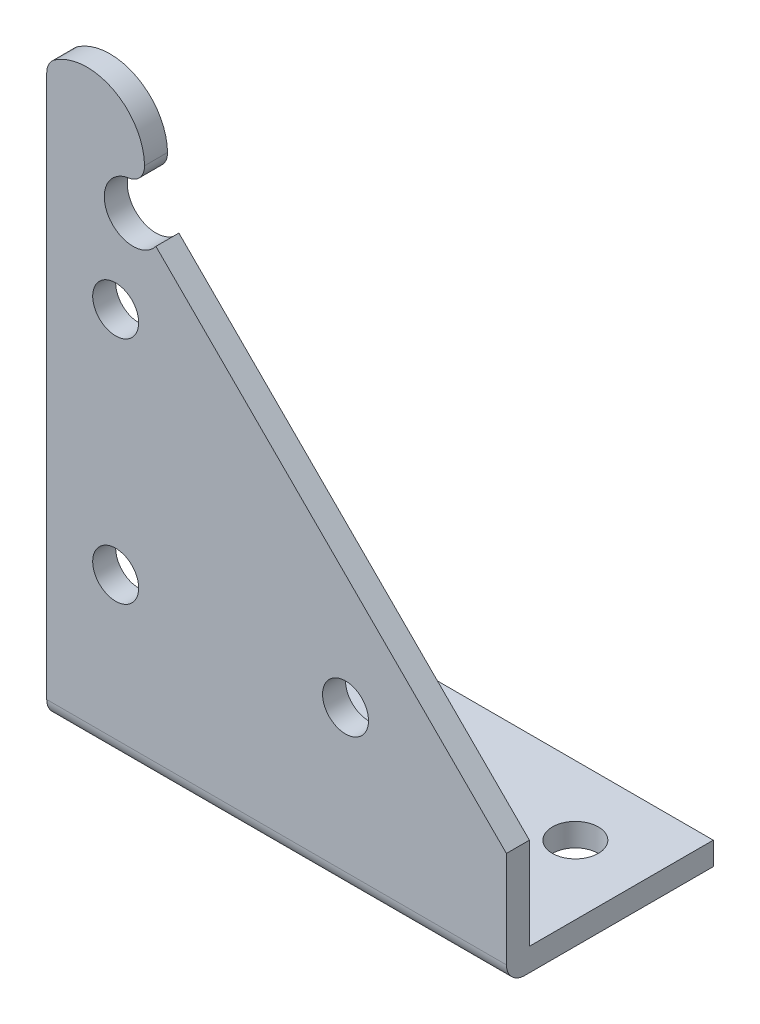
ISO-10303-21;
HEADER;
FILE_DESCRIPTION(('STEP AP214'),'2;1');
FILE_NAME('part.step','',(''),(''),'','','');
FILE_SCHEMA(('AUTOMOTIVE_DESIGN { 1 0 10303 214 1 1 1 1 }'));
ENDSEC;
DATA;
#1=APPLICATION_CONTEXT('core data for automotive mechanical design processes');
#2=APPLICATION_PROTOCOL_DEFINITION('international standard','automotive_design',2000,#1);
#3=PRODUCT_CONTEXT('',#1,'mechanical');
#4=PRODUCT('Part','Part','',(#3));
#5=PRODUCT_RELATED_PRODUCT_CATEGORY('part','',(#4));
#6=PRODUCT_DEFINITION_FORMATION('','',#4);
#7=PRODUCT_DEFINITION_CONTEXT('part definition',#1,'design');
#8=PRODUCT_DEFINITION('design','',#6,#7);
#9=PRODUCT_DEFINITION_SHAPE('','',#8);
#10=(LENGTH_UNIT() NAMED_UNIT(*) SI_UNIT(.MILLI.,.METRE.));
#11=(NAMED_UNIT(*) PLANE_ANGLE_UNIT() SI_UNIT($,.RADIAN.));
#12=(NAMED_UNIT(*) SI_UNIT($,.STERADIAN.) SOLID_ANGLE_UNIT());
#13=UNCERTAINTY_MEASURE_WITH_UNIT(LENGTH_MEASURE(1.E-05),#10,'distance_accuracy_value','');
#14=(GEOMETRIC_REPRESENTATION_CONTEXT(3) GLOBAL_UNCERTAINTY_ASSIGNED_CONTEXT((#13)) GLOBAL_UNIT_ASSIGNED_CONTEXT((#10,
#11,#12)) REPRESENTATION_CONTEXT('',''));
#15=CARTESIAN_POINT('',(0.,0.,0.));
#16=DIRECTION('',(0.,0.,1.));
#17=DIRECTION('',(1.,0.,0.));
#18=AXIS2_PLACEMENT_3D('',#15,#16,#17);
#19=CARTESIAN_POINT('',(-29.3624,44.45,-3.175));
#20=DIRECTION('',(0.,0.,-1.));
#21=DIRECTION('',(1.,0.,0.));
#22=AXIS2_PLACEMENT_3D('',#19,#20,#21);
#23=PLANE('',#22);
#24=DIRECTION('',(-1.,0.,0.));
#25=VECTOR('',#24,1.);
#26=CARTESIAN_POINT('',(-41.275,-19.05,-3.175));
#27=LINE('',#26,#25);
#28=CARTESIAN_POINT('',(22.225,-19.05,-3.175));
#29=VERTEX_POINT('',#28);
#30=CARTESIAN_POINT('',(-41.275,-19.05,-3.175));
#31=VERTEX_POINT('',#30);
#32=EDGE_CURVE('E152',#29,#31,#27,.T.);
#33=ORIENTED_EDGE('',*,*,#32,.T.);
#34=DIRECTION('',(0.,-1.,0.));
#35=VECTOR('',#34,1.);
#36=CARTESIAN_POINT('',(-41.275,55.287109679961,-3.175));
#37=LINE('',#36,#35);
#38=CARTESIAN_POINT('',(-41.275,55.287109679961,-3.175));
#39=VERTEX_POINT('',#38);
#40=EDGE_CURVE('E142',#39,#31,#37,.T.);
#41=ORIENTED_EDGE('',*,*,#40,.F.);
#42=CARTESIAN_POINT('',(-38.735,55.287109679961,-3.175));
#43=DIRECTION('',(0.,0.,1.));
#44=DIRECTION('',(-1.,0.,0.));
#45=AXIS2_PLACEMENT_3D('',#42,#43,#44);
#46=CIRCLE('',#45,2.54);
#47=CARTESIAN_POINT('',(-40.1540610328639,57.3937339428535,-3.175));
#48=VERTEX_POINT('',#47);
#49=EDGE_CURVE('E189',#48,#39,#46,.T.);
#50=ORIENTED_EDGE('',*,*,#49,.F.);
#51=CARTESIAN_POINT('',(-35.7124,50.8,-3.175));
#52=DIRECTION('',(0.,0.,1.));
#53=DIRECTION('',(1.,0.,0.));
#54=AXIS2_PLACEMENT_3D('',#51,#52,#53);
#55=CIRCLE('',#54,7.95019999999999);
#56=CARTESIAN_POINT('',(-27.7631590173173,50.9234821413682,-3.175));
#57=VERTEX_POINT('',#56);
#58=EDGE_CURVE('E186',#57,#48,#55,.T.);
#59=ORIENTED_EDGE('',*,*,#58,.F.);
#60=CARTESIAN_POINT('',(-30.3028526220082,50.8840309779918,-3.175));
#61=DIRECTION('',(0.,0.,1.));
#62=DIRECTION('',(1.,0.,0.));
#63=AXIS2_PLACEMENT_3D('',#60,#61,#62);
#64=CIRCLE('',#63,2.54);
#65=CARTESIAN_POINT('',(-29.9354883165363,48.3707376272137,-3.175));
#66=VERTEX_POINT('',#65);
#67=EDGE_CURVE('E183',#66,#57,#64,.T.);
#68=ORIENTED_EDGE('',*,*,#67,.F.);
#69=CARTESIAN_POINT('',(-29.3624,44.45,-3.175));
#70=DIRECTION('',(0.,0.,-1.));
#71=DIRECTION('',(1.,0.,0.));
#72=AXIS2_PLACEMENT_3D('',#69,#70,#71);
#73=CIRCLE('',#72,3.9624);
#74=CARTESIAN_POINT('',(-26.1946583294408,42.0696583294403,-3.175));
#75=VERTEX_POINT('',#74);
#76=EDGE_CURVE('E180',#75,#66,#73,.T.);
#77=ORIENTED_EDGE('',*,*,#76,.F.);
#78=DIRECTION('',(-0.707106781186551,0.707106781186544,0.));
#79=VECTOR('',#78,1.);
#80=CARTESIAN_POINT('',(22.225,-6.34999999999999,-3.175));
#81=LINE('',#80,#79);
#82=CARTESIAN_POINT('',(22.225,-6.34999999999999,-3.175));
#83=VERTEX_POINT('',#82);
#84=EDGE_CURVE('E176',#83,#75,#81,.T.);
#85=ORIENTED_EDGE('',*,*,#84,.F.);
#86=DIRECTION('',(0.,1.,0.));
#87=VECTOR('',#86,1.);
#88=CARTESIAN_POINT('',(22.225,-22.225,-3.175));
#89=LINE('',#88,#87);
#90=EDGE_CURVE('E173',#29,#83,#89,.T.);
#91=ORIENTED_EDGE('',*,*,#90,.F.);
#92=EDGE_LOOP('',(#33,#41,#50,#59,#68,#77,#85,#91));
#93=FACE_BOUND('',#92,.T.);
#94=CARTESIAN_POINT('',(-31.75,0.,-3.175));
#95=DIRECTION('',(0.,0.,1.));
#96=DIRECTION('',(1.,0.,0.));
#97=AXIS2_PLACEMENT_3D('',#94,#95,#96);
#98=CIRCLE('',#97,3.175);
#99=CARTESIAN_POINT('',(-28.575,0.,-3.175));
#100=VERTEX_POINT('',#99);
#101=EDGE_CURVE('E161',#100,#100,#98,.T.);
#102=ORIENTED_EDGE('',*,*,#101,.T.);
#103=EDGE_LOOP('',(#102));
#104=FACE_BOUND('',#103,.T.);
#105=CARTESIAN_POINT('',(0.,0.,-3.175));
#106=DIRECTION('',(0.,0.,1.));
#107=DIRECTION('',(1.,0.,0.));
#108=AXIS2_PLACEMENT_3D('',#105,#106,#107);
#109=CIRCLE('',#108,3.175);
#110=CARTESIAN_POINT('',(3.175,0.,-3.175));
#111=VERTEX_POINT('',#110);
#112=EDGE_CURVE('E167',#111,#111,#109,.T.);
#113=ORIENTED_EDGE('',*,*,#112,.T.);
#114=EDGE_LOOP('',(#113));
#115=FACE_BOUND('',#114,.T.);
#116=CARTESIAN_POINT('',(-31.75,31.75,-3.175));
#117=DIRECTION('',(0.,0.,1.));
#118=DIRECTION('',(1.,0.,0.));
#119=AXIS2_PLACEMENT_3D('',#116,#117,#118);
#120=CIRCLE('',#119,3.175);
#121=CARTESIAN_POINT('',(-28.575,31.75,-3.175));
#122=VERTEX_POINT('',#121);
#123=EDGE_CURVE('E155',#122,#122,#120,.T.);
#124=ORIENTED_EDGE('',*,*,#123,.T.);
#125=EDGE_LOOP('',(#124));
#126=FACE_BOUND('',#125,.T.);
#127=ADVANCED_FACE('F37',(#93,#104,#115,#126),#23,.T.);
#128=CARTESIAN_POINT('',(-29.3624,44.45,0.));
#129=DIRECTION('',(0.,0.,-1.));
#130=DIRECTION('',(1.,0.,0.));
#131=AXIS2_PLACEMENT_3D('',#128,#129,#130);
#132=PLANE('',#131);
#133=DIRECTION('',(0.,1.,0.));
#134=VECTOR('',#133,1.);
#135=CARTESIAN_POINT('',(22.225,-22.225,0.));
#136=LINE('',#135,#134);
#137=CARTESIAN_POINT('',(22.225,-19.685,0.));
#138=VERTEX_POINT('',#137);
#139=CARTESIAN_POINT('',(22.225,-6.34999999999999,0.));
#140=VERTEX_POINT('',#139);
#141=EDGE_CURVE('E170',#138,#140,#136,.T.);
#142=ORIENTED_EDGE('',*,*,#141,.T.);
#143=DIRECTION('',(-0.707106781186551,0.707106781186544,0.));
#144=VECTOR('',#143,1.);
#145=CARTESIAN_POINT('',(22.225,-6.34999999999999,0.));
#146=LINE('',#145,#144);
#147=CARTESIAN_POINT('',(-26.1946583294408,42.0696583294403,0.));
#148=VERTEX_POINT('',#147);
#149=EDGE_CURVE('E196',#140,#148,#146,.T.);
#150=ORIENTED_EDGE('',*,*,#149,.T.);
#151=CARTESIAN_POINT('',(-29.3624,44.45,0.));
#152=DIRECTION('',(0.,0.,-1.));
#153=DIRECTION('',(1.,0.,0.));
#154=AXIS2_PLACEMENT_3D('',#151,#152,#153);
#155=CIRCLE('',#154,3.9624);
#156=CARTESIAN_POINT('',(-29.9354883165363,48.3707376272137,0.));
#157=VERTEX_POINT('',#156);
#158=EDGE_CURVE('E199',#148,#157,#155,.T.);
#159=ORIENTED_EDGE('',*,*,#158,.T.);
#160=CARTESIAN_POINT('',(-30.3028526220082,50.8840309779918,0.));
#161=DIRECTION('',(0.,0.,1.));
#162=DIRECTION('',(1.,0.,0.));
#163=AXIS2_PLACEMENT_3D('',#160,#161,#162);
#164=CIRCLE('',#163,2.54);
#165=CARTESIAN_POINT('',(-27.7631590173173,50.9234821413682,0.));
#166=VERTEX_POINT('',#165);
#167=EDGE_CURVE('E202',#157,#166,#164,.T.);
#168=ORIENTED_EDGE('',*,*,#167,.T.);
#169=CARTESIAN_POINT('',(-35.7124,50.8,0.));
#170=DIRECTION('',(0.,0.,1.));
#171=DIRECTION('',(1.,0.,0.));
#172=AXIS2_PLACEMENT_3D('',#169,#170,#171);
#173=CIRCLE('',#172,7.95019999999999);
#174=CARTESIAN_POINT('',(-40.1540610328639,57.3937339428535,0.));
#175=VERTEX_POINT('',#174);
#176=EDGE_CURVE('E205',#166,#175,#173,.T.);
#177=ORIENTED_EDGE('',*,*,#176,.T.);
#178=CARTESIAN_POINT('',(-38.735,55.287109679961,0.));
#179=DIRECTION('',(0.,0.,1.));
#180=DIRECTION('',(-1.,0.,0.));
#181=AXIS2_PLACEMENT_3D('',#178,#179,#180);
#182=CIRCLE('',#181,2.54);
#183=CARTESIAN_POINT('',(-41.275,55.287109679961,0.));
#184=VERTEX_POINT('',#183);
#185=EDGE_CURVE('E208',#175,#184,#182,.T.);
#186=ORIENTED_EDGE('',*,*,#185,.T.);
#187=DIRECTION('',(0.,-1.,0.));
#188=VECTOR('',#187,1.);
#189=CARTESIAN_POINT('',(-41.275,55.287109679961,0.));
#190=LINE('',#189,#188);
#191=CARTESIAN_POINT('',(-41.275,-19.685,0.));
#192=VERTEX_POINT('',#191);
#193=EDGE_CURVE('E177',#184,#192,#190,.T.);
#194=ORIENTED_EDGE('',*,*,#193,.T.);
#195=DIRECTION('',(1.,0.,0.));
#196=VECTOR('',#195,1.);
#197=CARTESIAN_POINT('',(-29.3624,-19.685,0.));
#198=LINE('',#197,#196);
#199=EDGE_CURVE('E45',#138,#192,#198,.F.);
#200=ORIENTED_EDGE('',*,*,#199,.F.);
#201=EDGE_LOOP('',(#142,#150,#159,#168,#177,#186,#194,#200));
#202=FACE_BOUND('',#201,.T.);
#203=CARTESIAN_POINT('',(0.,0.,0.));
#204=DIRECTION('',(0.,0.,1.));
#205=DIRECTION('',(1.,0.,0.));
#206=AXIS2_PLACEMENT_3D('',#203,#204,#205);
#207=CIRCLE('',#206,3.175);
#208=CARTESIAN_POINT('',(3.175,0.,0.));
#209=VERTEX_POINT('',#208);
#210=EDGE_CURVE('E164',#209,#209,#207,.T.);
#211=ORIENTED_EDGE('',*,*,#210,.F.);
#212=EDGE_LOOP('',(#211));
#213=FACE_BOUND('',#212,.T.);
#214=CARTESIAN_POINT('',(-31.75,0.,0.));
#215=DIRECTION('',(0.,0.,1.));
#216=DIRECTION('',(1.,0.,0.));
#217=AXIS2_PLACEMENT_3D('',#214,#215,#216);
#218=CIRCLE('',#217,3.175);
#219=CARTESIAN_POINT('',(-28.575,0.,0.));
#220=VERTEX_POINT('',#219);
#221=EDGE_CURVE('E158',#220,#220,#218,.T.);
#222=ORIENTED_EDGE('',*,*,#221,.F.);
#223=EDGE_LOOP('',(#222));
#224=FACE_BOUND('',#223,.T.);
#225=CARTESIAN_POINT('',(-31.75,31.75,0.));
#226=DIRECTION('',(0.,0.,1.));
#227=DIRECTION('',(1.,0.,0.));
#228=AXIS2_PLACEMENT_3D('',#225,#226,#227);
#229=CIRCLE('',#228,3.175);
#230=CARTESIAN_POINT('',(-28.575,31.75,0.));
#231=VERTEX_POINT('',#230);
#232=EDGE_CURVE('E137',#231,#231,#229,.T.);
#233=ORIENTED_EDGE('',*,*,#232,.F.);
#234=EDGE_LOOP('',(#233));
#235=FACE_BOUND('',#234,.T.);
#236=ADVANCED_FACE('F233',(#202,#213,#224,#235),#132,.F.);
#237=CARTESIAN_POINT('',(22.225,-22.225,-3.175));
#238=DIRECTION('',(-1.,0.,0.));
#239=DIRECTION('',(0.,0.,-1.));
#240=AXIS2_PLACEMENT_3D('',#237,#238,#239);
#241=PLANE('',#240);
#242=DIRECTION('',(0.,0.,1.));
#243=VECTOR('',#242,1.);
#244=CARTESIAN_POINT('',(22.225,-22.225,-3.175));
#245=LINE('',#244,#243);
#246=CARTESIAN_POINT('',(22.225,-22.225,-28.575));
#247=VERTEX_POINT('',#246);
#248=CARTESIAN_POINT('',(22.225,-22.225,-2.54));
#249=VERTEX_POINT('',#248);
#250=EDGE_CURVE('E193',#247,#249,#245,.T.);
#251=ORIENTED_EDGE('',*,*,#250,.F.);
#252=DIRECTION('',(0.,-1.,0.));
#253=VECTOR('',#252,1.);
#254=CARTESIAN_POINT('',(22.225,-19.05,-28.575));
#255=LINE('',#254,#253);
#256=CARTESIAN_POINT('',(22.225,-19.05,-28.575));
#257=VERTEX_POINT('',#256);
#258=EDGE_CURVE('E138',#257,#247,#255,.T.);
#259=ORIENTED_EDGE('',*,*,#258,.F.);
#260=DIRECTION('',(0.,0.,1.));
#261=VECTOR('',#260,1.);
#262=CARTESIAN_POINT('',(22.225,-19.05,-3.175));
#263=LINE('',#262,#261);
#264=EDGE_CURVE('E127',#257,#29,#263,.T.);
#265=ORIENTED_EDGE('',*,*,#264,.T.);
#266=ORIENTED_EDGE('',*,*,#90,.T.);
#267=DIRECTION('',(0.,0.,1.));
#268=VECTOR('',#267,1.);
#269=CARTESIAN_POINT('',(22.225,-6.34999999999999,-3.175));
#270=LINE('',#269,#268);
#271=EDGE_CURVE('E227',#83,#140,#270,.T.);
#272=ORIENTED_EDGE('',*,*,#271,.T.);
#273=ORIENTED_EDGE('',*,*,#141,.F.);
#274=CARTESIAN_POINT('',(22.225,-19.685,-2.54));
#275=DIRECTION('',(1.,0.,0.));
#276=DIRECTION('',(0.,0.,-1.));
#277=AXIS2_PLACEMENT_3D('',#274,#275,#276);
#278=CIRCLE('',#277,2.54);
#279=EDGE_CURVE('E57',#249,#138,#278,.F.);
#280=ORIENTED_EDGE('',*,*,#279,.F.);
#281=EDGE_LOOP('',(#251,#259,#265,#266,#272,#273,#280));
#282=FACE_BOUND('',#281,.T.);
#283=ADVANCED_FACE('F247',(#282),#241,.F.);
#284=CARTESIAN_POINT('',(22.225,-6.34999999999999,-3.175));
#285=DIRECTION('',(-0.707106781186543,-0.707106781186551,0.));
#286=DIRECTION('',(0.707106781186551,-0.707106781186544,0.));
#287=AXIS2_PLACEMENT_3D('',#284,#285,#286);
#288=PLANE('',#287);
#289=ORIENTED_EDGE('',*,*,#149,.F.);
#290=ORIENTED_EDGE('',*,*,#271,.F.);
#291=ORIENTED_EDGE('',*,*,#84,.T.);
#292=DIRECTION('',(0.,0.,1.));
#293=VECTOR('',#292,1.);
#294=CARTESIAN_POINT('',(-26.1946583294408,42.0696583294403,-3.175));
#295=LINE('',#294,#293);
#296=EDGE_CURVE('E225',#75,#148,#295,.T.);
#297=ORIENTED_EDGE('',*,*,#296,.T.);
#298=EDGE_LOOP('',(#289,#290,#291,#297));
#299=FACE_BOUND('',#298,.T.);
#300=ADVANCED_FACE('F315',(#299),#288,.F.);
#301=CARTESIAN_POINT('',(-29.3624,44.45,-3.175));
#302=DIRECTION('',(0.,0.,1.));
#303=DIRECTION('',(-1.,0.,0.));
#304=AXIS2_PLACEMENT_3D('',#301,#302,#303);
#305=CYLINDRICAL_SURFACE('',#304,3.9624);
#306=ORIENTED_EDGE('',*,*,#158,.F.);
#307=ORIENTED_EDGE('',*,*,#296,.F.);
#308=ORIENTED_EDGE('',*,*,#76,.T.);
#309=DIRECTION('',(0.,0.,1.));
#310=VECTOR('',#309,1.);
#311=CARTESIAN_POINT('',(-29.9354883165363,48.3707376272137,-3.175));
#312=LINE('',#311,#310);
#313=EDGE_CURVE('E223',#66,#157,#312,.T.);
#314=ORIENTED_EDGE('',*,*,#313,.T.);
#315=EDGE_LOOP('',(#306,#307,#308,#314));
#316=FACE_BOUND('',#315,.T.);
#317=ADVANCED_FACE('F311',(#316),#305,.F.);
#318=CARTESIAN_POINT('',(-30.3028526220082,50.8840309779918,-3.175));
#319=DIRECTION('',(0.,0.,1.));
#320=DIRECTION('',(-1.,0.,0.));
#321=AXIS2_PLACEMENT_3D('',#318,#319,#320);
#322=CYLINDRICAL_SURFACE('',#321,2.54);
#323=ORIENTED_EDGE('',*,*,#167,.F.);
#324=ORIENTED_EDGE('',*,*,#313,.F.);
#325=ORIENTED_EDGE('',*,*,#67,.T.);
#326=DIRECTION('',(0.,0.,1.));
#327=VECTOR('',#326,1.);
#328=CARTESIAN_POINT('',(-27.7631590173173,50.9234821413682,-3.175));
#329=LINE('',#328,#327);
#330=EDGE_CURVE('E221',#57,#166,#329,.T.);
#331=ORIENTED_EDGE('',*,*,#330,.T.);
#332=EDGE_LOOP('',(#323,#324,#325,#331));
#333=FACE_BOUND('',#332,.T.);
#334=ADVANCED_FACE('F307',(#333),#322,.T.);
#335=CARTESIAN_POINT('',(-35.7124,50.8,-3.175));
#336=DIRECTION('',(0.,0.,1.));
#337=DIRECTION('',(-1.,0.,0.));
#338=AXIS2_PLACEMENT_3D('',#335,#336,#337);
#339=CYLINDRICAL_SURFACE('',#338,7.95019999999999);
#340=ORIENTED_EDGE('',*,*,#176,.F.);
#341=ORIENTED_EDGE('',*,*,#330,.F.);
#342=ORIENTED_EDGE('',*,*,#58,.T.);
#343=DIRECTION('',(0.,0.,1.));
#344=VECTOR('',#343,1.);
#345=CARTESIAN_POINT('',(-40.1540610328639,57.3937339428535,-3.175));
#346=LINE('',#345,#344);
#347=EDGE_CURVE('E219',#48,#175,#346,.T.);
#348=ORIENTED_EDGE('',*,*,#347,.T.);
#349=EDGE_LOOP('',(#340,#341,#342,#348));
#350=FACE_BOUND('',#349,.T.);
#351=ADVANCED_FACE('F304',(#350),#339,.T.);
#352=CARTESIAN_POINT('',(-38.735,55.287109679961,-3.175));
#353=DIRECTION('',(0.,0.,1.));
#354=DIRECTION('',(-1.,0.,0.));
#355=AXIS2_PLACEMENT_3D('',#352,#353,#354);
#356=CYLINDRICAL_SURFACE('',#355,2.54);
#357=ORIENTED_EDGE('',*,*,#185,.F.);
#358=ORIENTED_EDGE('',*,*,#347,.F.);
#359=ORIENTED_EDGE('',*,*,#49,.T.);
#360=DIRECTION('',(0.,0.,1.));
#361=VECTOR('',#360,1.);
#362=CARTESIAN_POINT('',(-41.275,55.287109679961,-3.175));
#363=LINE('',#362,#361);
#364=EDGE_CURVE('E217',#39,#184,#363,.T.);
#365=ORIENTED_EDGE('',*,*,#364,.T.);
#366=EDGE_LOOP('',(#357,#358,#359,#365));
#367=FACE_BOUND('',#366,.T.);
#368=ADVANCED_FACE('F238',(#367),#356,.T.);
#369=CARTESIAN_POINT('',(-41.275,55.287109679961,-3.175));
#370=DIRECTION('',(1.,0.,0.));
#371=DIRECTION('',(0.,0.,1.));
#372=AXIS2_PLACEMENT_3D('',#369,#370,#371);
#373=PLANE('',#372);
#374=ORIENTED_EDGE('',*,*,#193,.F.);
#375=ORIENTED_EDGE('',*,*,#364,.F.);
#376=ORIENTED_EDGE('',*,*,#40,.T.);
#377=DIRECTION('',(0.,0.,-1.));
#378=VECTOR('',#377,1.);
#379=CARTESIAN_POINT('',(-41.275,-19.05,-3.175));
#380=LINE('',#379,#378);
#381=CARTESIAN_POINT('',(-41.275,-19.05,-28.575));
#382=VERTEX_POINT('',#381);
#383=EDGE_CURVE('E125',#31,#382,#380,.T.);
#384=ORIENTED_EDGE('',*,*,#383,.T.);
#385=DIRECTION('',(0.,-1.,0.));
#386=VECTOR('',#385,1.);
#387=CARTESIAN_POINT('',(-41.275,-19.05,-28.575));
#388=LINE('',#387,#386);
#389=CARTESIAN_POINT('',(-41.275,-22.225,-28.575));
#390=VERTEX_POINT('',#389);
#391=EDGE_CURVE('E133',#382,#390,#388,.T.);
#392=ORIENTED_EDGE('',*,*,#391,.T.);
#393=DIRECTION('',(0.,0.,1.));
#394=VECTOR('',#393,1.);
#395=CARTESIAN_POINT('',(-41.275,-22.225,-3.175));
#396=LINE('',#395,#394);
#397=CARTESIAN_POINT('',(-41.275,-22.225,-2.54));
#398=VERTEX_POINT('',#397);
#399=EDGE_CURVE('E215',#390,#398,#396,.T.);
#400=ORIENTED_EDGE('',*,*,#399,.T.);
#401=CARTESIAN_POINT('',(-41.275,-19.685,-2.54));
#402=DIRECTION('',(-1.,0.,0.));
#403=DIRECTION('',(0.,0.,1.));
#404=AXIS2_PLACEMENT_3D('',#401,#402,#403);
#405=CIRCLE('',#404,2.54);
#406=EDGE_CURVE('E11',#192,#398,#405,.F.);
#407=ORIENTED_EDGE('',*,*,#406,.F.);
#408=EDGE_LOOP('',(#374,#375,#376,#384,#392,#400,#407));
#409=FACE_BOUND('',#408,.T.);
#410=ADVANCED_FACE('F140',(#409),#373,.F.);
#411=CARTESIAN_POINT('',(-41.275,-22.225,-3.175));
#412=DIRECTION('',(0.,1.,0.));
#413=DIRECTION('',(-1.,0.,0.));
#414=AXIS2_PLACEMENT_3D('',#411,#412,#413);
#415=PLANE('',#414);
#416=ORIENTED_EDGE('',*,*,#399,.F.);
#417=DIRECTION('',(1.,0.,0.));
#418=VECTOR('',#417,1.);
#419=CARTESIAN_POINT('',(-41.275,-22.225,-28.575));
#420=LINE('',#419,#418);
#421=EDGE_CURVE('E135',#390,#247,#420,.T.);
#422=ORIENTED_EDGE('',*,*,#421,.T.);
#423=ORIENTED_EDGE('',*,*,#250,.T.);
#424=DIRECTION('',(1.,0.,0.));
#425=VECTOR('',#424,1.);
#426=CARTESIAN_POINT('',(-41.275,-22.225,-2.54));
#427=LINE('',#426,#425);
#428=EDGE_CURVE('E229',#398,#249,#427,.T.);
#429=ORIENTED_EDGE('',*,*,#428,.F.);
#430=EDGE_LOOP('',(#416,#422,#423,#429));
#431=FACE_BOUND('',#430,.T.);
#432=CARTESIAN_POINT('',(-9.525,-22.225,-15.875));
#433=DIRECTION('',(0.,-1.,0.));
#434=DIRECTION('',(0.,0.,-1.));
#435=AXIS2_PLACEMENT_3D('',#432,#433,#434);
#436=CIRCLE('',#435,3.175);
#437=CARTESIAN_POINT('',(-9.525,-22.225,-19.05));
#438=VERTEX_POINT('',#437);
#439=EDGE_CURVE('E148',#438,#438,#436,.T.);
#440=ORIENTED_EDGE('',*,*,#439,.F.);
#441=EDGE_LOOP('',(#440));
#442=FACE_BOUND('',#441,.T.);
#443=CARTESIAN_POINT('',(-31.75,-22.225,-19.05));
#444=DIRECTION('',(0.,-1.,0.));
#445=DIRECTION('',(0.,0.,-1.));
#446=AXIS2_PLACEMENT_3D('',#443,#444,#445);
#447=CIRCLE('',#446,3.175);
#448=CARTESIAN_POINT('',(-31.75,-22.225,-22.225));
#449=VERTEX_POINT('',#448);
#450=EDGE_CURVE('E261',#449,#449,#447,.T.);
#451=ORIENTED_EDGE('',*,*,#450,.F.);
#452=EDGE_LOOP('',(#451));
#453=FACE_BOUND('',#452,.T.);
#454=CARTESIAN_POINT('',(12.7,-22.225,-19.05));
#455=DIRECTION('',(0.,-1.,0.));
#456=DIRECTION('',(0.,0.,-1.));
#457=AXIS2_PLACEMENT_3D('',#454,#455,#456);
#458=CIRCLE('',#457,3.175);
#459=CARTESIAN_POINT('',(12.7,-22.225,-22.225));
#460=VERTEX_POINT('',#459);
#461=EDGE_CURVE('E264',#460,#460,#458,.T.);
#462=ORIENTED_EDGE('',*,*,#461,.F.);
#463=EDGE_LOOP('',(#462));
#464=FACE_BOUND('',#463,.T.);
#465=ADVANCED_FACE('F250',(#431,#442,#453,#464),#415,.F.);
#466=CARTESIAN_POINT('',(0.,0.,-3.175));
#467=DIRECTION('',(0.,0.,1.));
#468=DIRECTION('',(-1.,0.,0.));
#469=AXIS2_PLACEMENT_3D('',#466,#467,#468);
#470=CYLINDRICAL_SURFACE('',#469,3.175);
#471=ORIENTED_EDGE('',*,*,#112,.F.);
#472=EDGE_LOOP('',(#471));
#473=FACE_BOUND('',#472,.T.);
#474=ORIENTED_EDGE('',*,*,#210,.T.);
#475=EDGE_LOOP('',(#474));
#476=FACE_BOUND('',#475,.T.);
#477=ADVANCED_FACE('F253',(#473,#476),#470,.F.);
#478=CARTESIAN_POINT('',(-31.75,0.,-3.175));
#479=DIRECTION('',(0.,0.,1.));
#480=DIRECTION('',(-1.,0.,0.));
#481=AXIS2_PLACEMENT_3D('',#478,#479,#480);
#482=CYLINDRICAL_SURFACE('',#481,3.175);
#483=ORIENTED_EDGE('',*,*,#101,.F.);
#484=EDGE_LOOP('',(#483));
#485=FACE_BOUND('',#484,.T.);
#486=ORIENTED_EDGE('',*,*,#221,.T.);
#487=EDGE_LOOP('',(#486));
#488=FACE_BOUND('',#487,.T.);
#489=ADVANCED_FACE('F358',(#485,#488),#482,.F.);
#490=CARTESIAN_POINT('',(-31.75,31.75,-3.175));
#491=DIRECTION('',(0.,0.,1.));
#492=DIRECTION('',(-1.,0.,0.));
#493=AXIS2_PLACEMENT_3D('',#490,#491,#492);
#494=CYLINDRICAL_SURFACE('',#493,3.175);
#495=ORIENTED_EDGE('',*,*,#123,.F.);
#496=EDGE_LOOP('',(#495));
#497=FACE_BOUND('',#496,.T.);
#498=ORIENTED_EDGE('',*,*,#232,.T.);
#499=EDGE_LOOP('',(#498));
#500=FACE_BOUND('',#499,.T.);
#501=ADVANCED_FACE('F365',(#497,#500),#494,.F.);
#502=CARTESIAN_POINT('',(0.,-19.05,0.));
#503=DIRECTION('',(0.,1.,0.));
#504=DIRECTION('',(0.,0.,-1.));
#505=AXIS2_PLACEMENT_3D('',#502,#503,#504);
#506=PLANE('',#505);
#507=CARTESIAN_POINT('',(-31.75,-19.05,-19.05));
#508=DIRECTION('',(0.,-1.,0.));
#509=DIRECTION('',(0.,0.,-1.));
#510=AXIS2_PLACEMENT_3D('',#507,#508,#509);
#511=CIRCLE('',#510,3.175);
#512=CARTESIAN_POINT('',(-31.75,-19.05,-22.225));
#513=VERTEX_POINT('',#512);
#514=EDGE_CURVE('E271',#513,#513,#511,.T.);
#515=ORIENTED_EDGE('',*,*,#514,.T.);
#516=EDGE_LOOP('',(#515));
#517=FACE_BOUND('',#516,.T.);
#518=ORIENTED_EDGE('',*,*,#383,.F.);
#519=ORIENTED_EDGE('',*,*,#32,.F.);
#520=ORIENTED_EDGE('',*,*,#264,.F.);
#521=DIRECTION('',(1.,0.,0.));
#522=VECTOR('',#521,1.);
#523=CARTESIAN_POINT('',(-41.275,-19.05,-28.575));
#524=LINE('',#523,#522);
#525=EDGE_CURVE('E119',#382,#257,#524,.T.);
#526=ORIENTED_EDGE('',*,*,#525,.F.);
#527=EDGE_LOOP('',(#518,#519,#520,#526));
#528=FACE_BOUND('',#527,.T.);
#529=CARTESIAN_POINT('',(-9.525,-19.05,-15.875));
#530=DIRECTION('',(0.,-1.,0.));
#531=DIRECTION('',(0.,0.,-1.));
#532=AXIS2_PLACEMENT_3D('',#529,#530,#531);
#533=CIRCLE('',#532,3.175);
#534=CARTESIAN_POINT('',(-9.525,-19.05,-19.05));
#535=VERTEX_POINT('',#534);
#536=EDGE_CURVE('E145',#535,#535,#533,.T.);
#537=ORIENTED_EDGE('',*,*,#536,.T.);
#538=EDGE_LOOP('',(#537));
#539=FACE_BOUND('',#538,.T.);
#540=CARTESIAN_POINT('',(12.7,-19.05,-19.05));
#541=DIRECTION('',(0.,-1.,0.));
#542=DIRECTION('',(0.,0.,-1.));
#543=AXIS2_PLACEMENT_3D('',#540,#541,#542);
#544=CIRCLE('',#543,3.175);
#545=CARTESIAN_POINT('',(12.7,-19.05,-22.225));
#546=VERTEX_POINT('',#545);
#547=EDGE_CURVE('E266',#546,#546,#544,.T.);
#548=ORIENTED_EDGE('',*,*,#547,.T.);
#549=EDGE_LOOP('',(#548));
#550=FACE_BOUND('',#549,.T.);
#551=ADVANCED_FACE('F121',(#517,#528,#539,#550),#506,.T.);
#552=CARTESIAN_POINT('',(-41.275,-19.05,-28.575));
#553=DIRECTION('',(0.,0.,1.));
#554=DIRECTION('',(-1.,0.,0.));
#555=AXIS2_PLACEMENT_3D('',#552,#553,#554);
#556=PLANE('',#555);
#557=ORIENTED_EDGE('',*,*,#421,.F.);
#558=ORIENTED_EDGE('',*,*,#391,.F.);
#559=ORIENTED_EDGE('',*,*,#525,.T.);
#560=ORIENTED_EDGE('',*,*,#258,.T.);
#561=EDGE_LOOP('',(#557,#558,#559,#560));
#562=FACE_BOUND('',#561,.T.);
#563=ADVANCED_FACE('F134',(#562),#556,.F.);
#564=CARTESIAN_POINT('',(-9.525,-19.05,-15.875));
#565=DIRECTION('',(0.,-1.,0.));
#566=DIRECTION('',(0.,0.,1.));
#567=AXIS2_PLACEMENT_3D('',#564,#565,#566);
#568=CYLINDRICAL_SURFACE('',#567,3.175);
#569=ORIENTED_EDGE('',*,*,#536,.F.);
#570=EDGE_LOOP('',(#569));
#571=FACE_BOUND('',#570,.T.);
#572=ORIENTED_EDGE('',*,*,#439,.T.);
#573=EDGE_LOOP('',(#572));
#574=FACE_BOUND('',#573,.T.);
#575=ADVANCED_FACE('F277',(#571,#574),#568,.F.);
#576=CARTESIAN_POINT('',(-31.75,-19.05,-19.05));
#577=DIRECTION('',(0.,-1.,0.));
#578=DIRECTION('',(0.,0.,1.));
#579=AXIS2_PLACEMENT_3D('',#576,#577,#578);
#580=CYLINDRICAL_SURFACE('',#579,3.175);
#581=ORIENTED_EDGE('',*,*,#514,.F.);
#582=EDGE_LOOP('',(#581));
#583=FACE_BOUND('',#582,.T.);
#584=ORIENTED_EDGE('',*,*,#450,.T.);
#585=EDGE_LOOP('',(#584));
#586=FACE_BOUND('',#585,.T.);
#587=ADVANCED_FACE('F279',(#583,#586),#580,.F.);
#588=CARTESIAN_POINT('',(12.7,-19.05,-19.05));
#589=DIRECTION('',(0.,-1.,0.));
#590=DIRECTION('',(0.,0.,1.));
#591=AXIS2_PLACEMENT_3D('',#588,#589,#590);
#592=CYLINDRICAL_SURFACE('',#591,3.175);
#593=ORIENTED_EDGE('',*,*,#547,.F.);
#594=EDGE_LOOP('',(#593));
#595=FACE_BOUND('',#594,.T.);
#596=ORIENTED_EDGE('',*,*,#461,.T.);
#597=EDGE_LOOP('',(#596));
#598=FACE_BOUND('',#597,.T.);
#599=ADVANCED_FACE('F286',(#595,#598),#592,.F.);
#600=CARTESIAN_POINT('',(-41.275,-19.685,-2.54));
#601=DIRECTION('',(1.,0.,0.));
#602=DIRECTION('',(0.,1.,0.));
#603=AXIS2_PLACEMENT_3D('',#600,#601,#602);
#604=CYLINDRICAL_SURFACE('',#603,2.54);
#605=ORIENTED_EDGE('',*,*,#406,.T.);
#606=ORIENTED_EDGE('',*,*,#428,.T.);
#607=ORIENTED_EDGE('',*,*,#279,.T.);
#608=ORIENTED_EDGE('',*,*,#199,.T.);
#609=EDGE_LOOP('',(#605,#606,#607,#608));
#610=FACE_BOUND('',#609,.T.);
#611=ADVANCED_FACE('F39',(#610),#604,.T.);
#612=CLOSED_SHELL('',(#127,#236,#283,#300,#317,#334,#351,#368,#410,#465,#477,#489,#501,#551,
#563,#575,#587,#599,#611));
#613=MANIFOLD_SOLID_BREP('B2',#612);
#614=ADVANCED_BREP_SHAPE_REPRESENTATION('',(#18,#613),#14);
#615=SHAPE_DEFINITION_REPRESENTATION(#9,#614);
ENDSEC;
END-ISO-10303-21;
